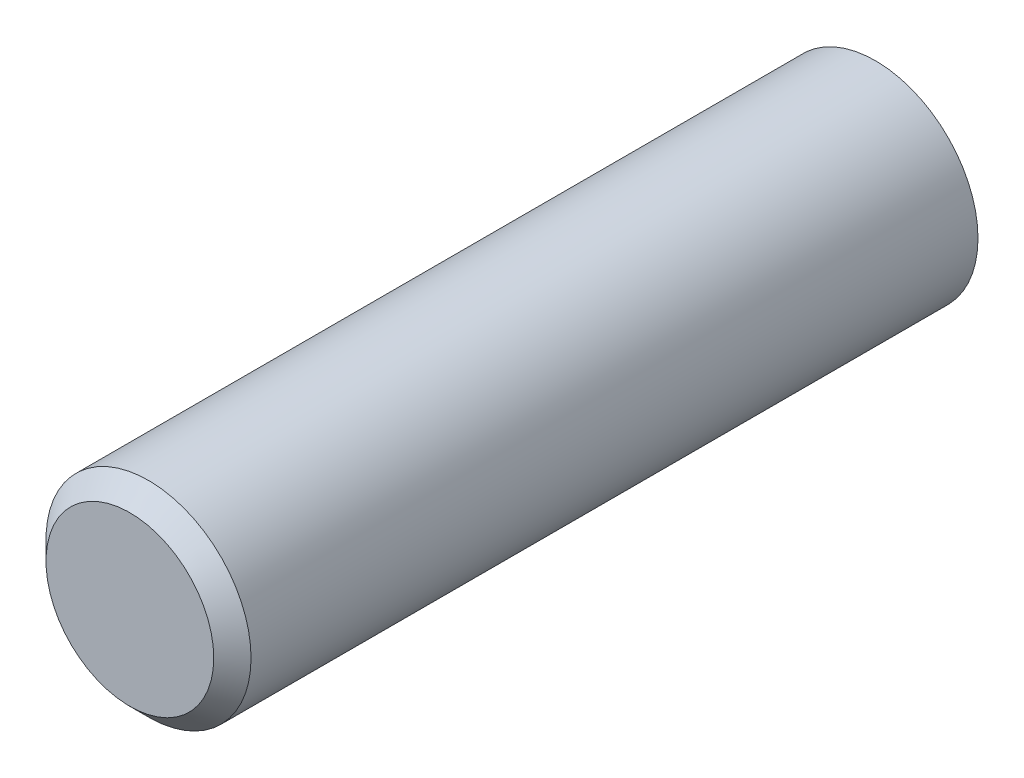
ISO-10303-21;
HEADER;
FILE_DESCRIPTION(('STEP AP214'),'2;1');
FILE_NAME('part.step','',(''),(''),'','','');
FILE_SCHEMA(('AUTOMOTIVE_DESIGN { 1 0 10303 214 1 1 1 1 }'));
ENDSEC;
DATA;
#1=APPLICATION_CONTEXT('core data for automotive mechanical design processes');
#2=APPLICATION_PROTOCOL_DEFINITION('international standard','automotive_design',2000,#1);
#3=PRODUCT_CONTEXT('',#1,'mechanical');
#4=PRODUCT('Part','Part','',(#3));
#5=PRODUCT_RELATED_PRODUCT_CATEGORY('part','',(#4));
#6=PRODUCT_DEFINITION_FORMATION('','',#4);
#7=PRODUCT_DEFINITION_CONTEXT('part definition',#1,'design');
#8=PRODUCT_DEFINITION('design','',#6,#7);
#9=PRODUCT_DEFINITION_SHAPE('','',#8);
#10=(LENGTH_UNIT() NAMED_UNIT(*) SI_UNIT(.MILLI.,.METRE.));
#11=(NAMED_UNIT(*) PLANE_ANGLE_UNIT() SI_UNIT($,.RADIAN.));
#12=(NAMED_UNIT(*) SI_UNIT($,.STERADIAN.) SOLID_ANGLE_UNIT());
#13=UNCERTAINTY_MEASURE_WITH_UNIT(LENGTH_MEASURE(1.E-05),#10,'distance_accuracy_value','');
#14=(GEOMETRIC_REPRESENTATION_CONTEXT(3) GLOBAL_UNCERTAINTY_ASSIGNED_CONTEXT((#13)) GLOBAL_UNIT_ASSIGNED_CONTEXT((#10,
#11,#12)) REPRESENTATION_CONTEXT('',''));
#15=CARTESIAN_POINT('',(0.,0.,0.));
#16=DIRECTION('',(0.,0.,1.));
#17=DIRECTION('',(1.,0.,0.));
#18=AXIS2_PLACEMENT_3D('',#15,#16,#17);
#19=CARTESIAN_POINT('',(0.,0.,40.));
#20=DIRECTION('',(0.,0.,-1.));
#21=DIRECTION('',(-1.,0.,0.));
#22=AXIS2_PLACEMENT_3D('',#19,#20,#21);
#23=CYLINDRICAL_SURFACE('',#22,4.7);
#24=CARTESIAN_POINT('',(0.,0.,0.));
#25=DIRECTION('',(0.,0.,1.));
#26=DIRECTION('',(1.,0.,0.));
#27=AXIS2_PLACEMENT_3D('',#24,#25,#26);
#28=CIRCLE('',#27,4.7);
#29=CARTESIAN_POINT('',(4.7,0.,0.));
#30=VERTEX_POINT('',#29);
#31=EDGE_CURVE('E46',#30,#30,#28,.T.);
#32=ORIENTED_EDGE('',*,*,#31,.F.);
#33=EDGE_LOOP('',(#32));
#34=FACE_BOUND('',#33,.T.);
#35=CARTESIAN_POINT('',(0.,0.,38.));
#36=DIRECTION('',(0.,0.,1.));
#37=DIRECTION('',(1.,0.,0.));
#38=AXIS2_PLACEMENT_3D('',#35,#36,#37);
#39=CIRCLE('',#38,4.7);
#40=CARTESIAN_POINT('',(4.7,0.,38.));
#41=VERTEX_POINT('',#40);
#42=EDGE_CURVE('E49',#41,#41,#39,.T.);
#43=ORIENTED_EDGE('',*,*,#42,.T.);
#44=EDGE_LOOP('',(#43));
#45=FACE_BOUND('',#44,.T.);
#46=ADVANCED_FACE('F31',(#34,#45),#23,.F.);
#47=CARTESIAN_POINT('',(0.,0.,40.));
#48=DIRECTION('',(0.,0.,1.));
#49=DIRECTION('',(1.,0.,0.));
#50=AXIS2_PLACEMENT_3D('',#47,#48,#49);
#51=PLANE('',#50);
#52=CARTESIAN_POINT('',(0.,0.,40.));
#53=DIRECTION('',(0.,0.,1.));
#54=DIRECTION('',(1.,0.,0.));
#55=AXIS2_PLACEMENT_3D('',#52,#53,#54);
#56=CIRCLE('',#55,4.5);
#57=CARTESIAN_POINT('',(4.5,0.,40.));
#58=VERTEX_POINT('',#57);
#59=EDGE_CURVE('E38',#58,#58,#56,.T.);
#60=ORIENTED_EDGE('',*,*,#59,.T.);
#61=EDGE_LOOP('',(#60));
#62=FACE_BOUND('',#61,.T.);
#63=ADVANCED_FACE('F59',(#62),#51,.T.);
#64=CARTESIAN_POINT('',(0.,0.,0.));
#65=DIRECTION('',(0.,0.,1.));
#66=DIRECTION('',(1.,0.,0.));
#67=AXIS2_PLACEMENT_3D('',#64,#65,#66);
#68=PLANE('',#67);
#69=CARTESIAN_POINT('',(0.,0.,0.));
#70=DIRECTION('',(0.,0.,1.));
#71=DIRECTION('',(1.,0.,0.));
#72=AXIS2_PLACEMENT_3D('',#69,#70,#71);
#73=CIRCLE('',#72,5.5);
#74=CARTESIAN_POINT('',(5.5,0.,0.));
#75=VERTEX_POINT('',#74);
#76=EDGE_CURVE('E42',#75,#75,#73,.T.);
#77=ORIENTED_EDGE('',*,*,#76,.F.);
#78=EDGE_LOOP('',(#77));
#79=FACE_BOUND('',#78,.T.);
#80=ORIENTED_EDGE('',*,*,#31,.T.);
#81=EDGE_LOOP('',(#80));
#82=FACE_BOUND('',#81,.T.);
#83=ADVANCED_FACE('F55',(#79,#82),#68,.F.);
#84=CARTESIAN_POINT('',(0.,0.,40.));
#85=DIRECTION('',(0.,0.,-1.));
#86=DIRECTION('',(-1.,0.,0.));
#87=AXIS2_PLACEMENT_3D('',#84,#85,#86);
#88=CYLINDRICAL_SURFACE('',#87,5.5);
#89=CARTESIAN_POINT('',(0.,0.,39.));
#90=DIRECTION('',(0.,0.,1.));
#91=DIRECTION('',(1.,0.,0.));
#92=AXIS2_PLACEMENT_3D('',#89,#90,#91);
#93=CIRCLE('',#92,5.5);
#94=CARTESIAN_POINT('',(5.5,0.,39.));
#95=VERTEX_POINT('',#94);
#96=EDGE_CURVE('E10',#95,#95,#93,.F.);
#97=ORIENTED_EDGE('',*,*,#96,.T.);
#98=EDGE_LOOP('',(#97));
#99=FACE_BOUND('',#98,.T.);
#100=ORIENTED_EDGE('',*,*,#76,.T.);
#101=EDGE_LOOP('',(#100));
#102=FACE_BOUND('',#101,.T.);
#103=ADVANCED_FACE('F65',(#99,#102),#88,.T.);
#104=CARTESIAN_POINT('',(0.,0.,38.));
#105=DIRECTION('',(0.,0.,1.));
#106=DIRECTION('',(1.,0.,0.));
#107=AXIS2_PLACEMENT_3D('',#104,#105,#106);
#108=PLANE('',#107);
#109=ORIENTED_EDGE('',*,*,#42,.F.);
#110=EDGE_LOOP('',(#109));
#111=FACE_BOUND('',#110,.T.);
#112=ADVANCED_FACE('F63',(#111),#108,.F.);
#113=CARTESIAN_POINT('',(0.,0.,40.));
#114=DIRECTION('',(0.,0.,-1.));
#115=DIRECTION('',(-1.,0.,0.));
#116=AXIS2_PLACEMENT_3D('',#113,#114,#115);
#117=CONICAL_SURFACE('',#116,4.5,0.785398163397449);
#118=ORIENTED_EDGE('',*,*,#96,.F.);
#119=EDGE_LOOP('',(#118));
#120=FACE_BOUND('',#119,.T.);
#121=ORIENTED_EDGE('',*,*,#59,.F.);
#122=EDGE_LOOP('',(#121));
#123=FACE_BOUND('',#122,.T.);
#124=ADVANCED_FACE('F33',(#120,#123),#117,.T.);
#125=CLOSED_SHELL('',(#46,#63,#83,#103,#112,#124));
#126=MANIFOLD_SOLID_BREP('B2',#125);
#127=ADVANCED_BREP_SHAPE_REPRESENTATION('',(#18,#126),#14);
#128=SHAPE_DEFINITION_REPRESENTATION(#9,#127);
ENDSEC;
END-ISO-10303-21;
